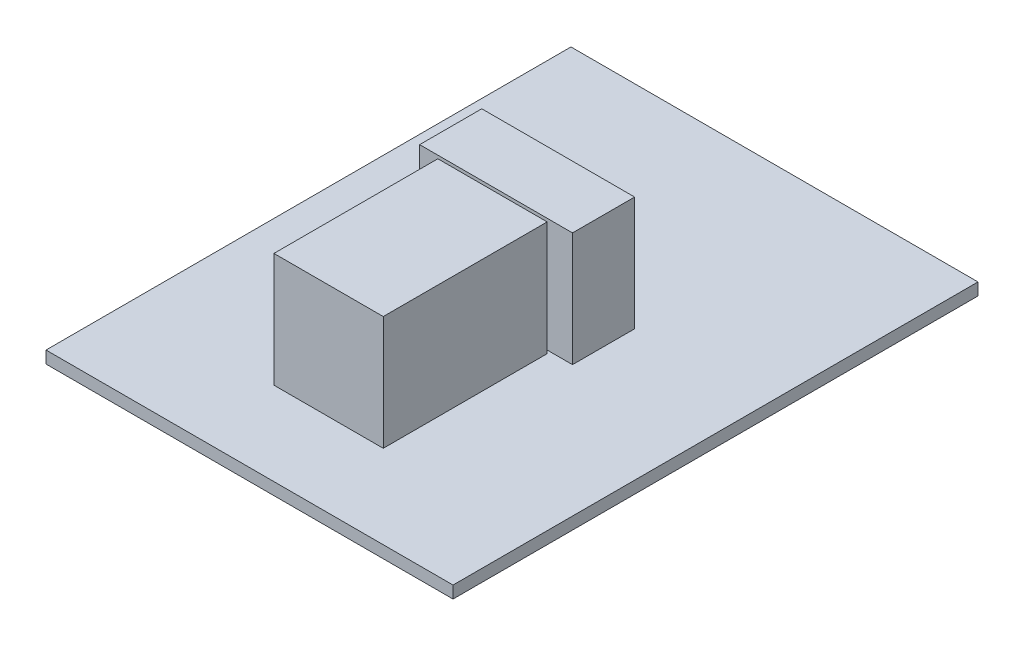
ISO-10303-21;
HEADER;
FILE_DESCRIPTION(('STEP AP214'),'2;1');
FILE_NAME('part.step','',(''),(''),'','','');
FILE_SCHEMA(('AUTOMOTIVE_DESIGN { 1 0 10303 214 1 1 1 1 }'));
ENDSEC;
DATA;
#1=APPLICATION_CONTEXT('core data for automotive mechanical design processes');
#2=APPLICATION_PROTOCOL_DEFINITION('international standard','automotive_design',2000,#1);
#3=PRODUCT_CONTEXT('',#1,'mechanical');
#4=PRODUCT('Part','Part','',(#3));
#5=PRODUCT_RELATED_PRODUCT_CATEGORY('part','',(#4));
#6=PRODUCT_DEFINITION_FORMATION('','',#4);
#7=PRODUCT_DEFINITION_CONTEXT('part definition',#1,'design');
#8=PRODUCT_DEFINITION('design','',#6,#7);
#9=PRODUCT_DEFINITION_SHAPE('','',#8);
#10=(LENGTH_UNIT() NAMED_UNIT(*) SI_UNIT(.MILLI.,.METRE.));
#11=(NAMED_UNIT(*) PLANE_ANGLE_UNIT() SI_UNIT($,.RADIAN.));
#12=(NAMED_UNIT(*) SI_UNIT($,.STERADIAN.) SOLID_ANGLE_UNIT());
#13=UNCERTAINTY_MEASURE_WITH_UNIT(LENGTH_MEASURE(1.E-05),#10,'distance_accuracy_value','');
#14=(GEOMETRIC_REPRESENTATION_CONTEXT(3) GLOBAL_UNCERTAINTY_ASSIGNED_CONTEXT((#13)) GLOBAL_UNIT_ASSIGNED_CONTEXT((#10,
#11,#12)) REPRESENTATION_CONTEXT('',''));
#15=CARTESIAN_POINT('',(0.,0.,0.));
#16=DIRECTION('',(0.,0.,1.));
#17=DIRECTION('',(1.,0.,0.));
#18=AXIS2_PLACEMENT_3D('',#15,#16,#17);
#19=CARTESIAN_POINT('',(53.5,1.6,-69.));
#20=DIRECTION('',(0.,-1.,0.));
#21=DIRECTION('',(0.,0.,-1.));
#22=AXIS2_PLACEMENT_3D('',#19,#20,#21);
#23=PLANE('',#22);
#24=DIRECTION('',(0.,0.,1.));
#25=VECTOR('',#24,1.);
#26=CARTESIAN_POINT('',(18.9824974393851,1.6,-10.9748289096387));
#27=LINE('',#26,#25);
#28=CARTESIAN_POINT('',(18.9824974393851,1.6,-32.5198358280829));
#29=VERTEX_POINT('',#28);
#30=CARTESIAN_POINT('',(18.9824974393851,1.6,-10.9748289096387));
#31=VERTEX_POINT('',#30);
#32=EDGE_CURVE('E172',#29,#31,#27,.T.);
#33=ORIENTED_EDGE('',*,*,#32,.F.);
#34=DIRECTION('',(-1.,0.,0.));
#35=VECTOR('',#34,1.);
#36=CARTESIAN_POINT('',(18.9824974393851,1.6,-32.5198358280829));
#37=LINE('',#36,#35);
#38=CARTESIAN_POINT('',(33.3533269301185,1.6,-32.5198358280829));
#39=VERTEX_POINT('',#38);
#40=EDGE_CURVE('E189',#39,#29,#37,.T.);
#41=ORIENTED_EDGE('',*,*,#40,.F.);
#42=DIRECTION('',(0.,0.,-1.));
#43=VECTOR('',#42,1.);
#44=CARTESIAN_POINT('',(33.3533269301185,1.6,-10.9748289096387));
#45=LINE('',#44,#43);
#46=CARTESIAN_POINT('',(33.3533269301185,1.6,-10.9748289096387));
#47=VERTEX_POINT('',#46);
#48=EDGE_CURVE('E202',#47,#39,#45,.T.);
#49=ORIENTED_EDGE('',*,*,#48,.F.);
#50=DIRECTION('',(1.,0.,0.));
#51=VECTOR('',#50,1.);
#52=CARTESIAN_POINT('',(18.9824974393851,1.6,-10.9748289096387));
#53=LINE('',#52,#51);
#54=EDGE_CURVE('E178',#31,#47,#53,.T.);
#55=ORIENTED_EDGE('',*,*,#54,.F.);
#56=EDGE_LOOP('',(#33,#41,#49,#55));
#57=FACE_BOUND('',#56,.T.);
#58=DIRECTION('',(0.,0.,-1.));
#59=VECTOR('',#58,1.);
#60=CARTESIAN_POINT('',(53.5,1.6,0.));
#61=LINE('',#60,#59);
#62=CARTESIAN_POINT('',(53.5,1.6,0.));
#63=VERTEX_POINT('',#62);
#64=CARTESIAN_POINT('',(53.5,1.6,-69.));
#65=VERTEX_POINT('',#64);
#66=EDGE_CURVE('E224',#63,#65,#61,.T.);
#67=ORIENTED_EDGE('',*,*,#66,.T.);
#68=DIRECTION('',(-1.,0.,0.));
#69=VECTOR('',#68,1.);
#70=CARTESIAN_POINT('',(0.,1.6,-69.));
#71=LINE('',#70,#69);
#72=CARTESIAN_POINT('',(0.,1.6,-69.));
#73=VERTEX_POINT('',#72);
#74=EDGE_CURVE('E228',#65,#73,#71,.T.);
#75=ORIENTED_EDGE('',*,*,#74,.T.);
#76=DIRECTION('',(0.,0.,1.));
#77=VECTOR('',#76,1.);
#78=CARTESIAN_POINT('',(0.,1.6,-69.));
#79=LINE('',#78,#77);
#80=CARTESIAN_POINT('',(0.,1.6,0.));
#81=VERTEX_POINT('',#80);
#82=EDGE_CURVE('E232',#73,#81,#79,.T.);
#83=ORIENTED_EDGE('',*,*,#82,.T.);
#84=DIRECTION('',(1.,0.,0.));
#85=VECTOR('',#84,1.);
#86=CARTESIAN_POINT('',(0.,1.6,0.));
#87=LINE('',#86,#85);
#88=EDGE_CURVE('E235',#81,#63,#87,.T.);
#89=ORIENTED_EDGE('',*,*,#88,.T.);
#90=EDGE_LOOP('',(#67,#75,#83,#89));
#91=FACE_BOUND('',#90,.T.);
#92=DIRECTION('',(0.,0.,1.));
#93=VECTOR('',#92,1.);
#94=CARTESIAN_POINT('',(16.1778659268137,1.6,-32.9338234642904));
#95=LINE('',#94,#93);
#96=CARTESIAN_POINT('',(16.1778659268137,1.6,-41.0976426044982));
#97=VERTEX_POINT('',#96);
#98=CARTESIAN_POINT('',(16.1778659268137,1.6,-32.9338234642904));
#99=VERTEX_POINT('',#98);
#100=EDGE_CURVE('E170',#97,#99,#95,.T.);
#101=ORIENTED_EDGE('',*,*,#100,.F.);
#102=DIRECTION('',(-1.,0.,0.));
#103=VECTOR('',#102,1.);
#104=CARTESIAN_POINT('',(16.1778659268137,1.6,-41.0976426044982));
#105=LINE('',#104,#103);
#106=CARTESIAN_POINT('',(36.2691980901353,1.6,-41.0976426044982));
#107=VERTEX_POINT('',#106);
#108=EDGE_CURVE('E167',#107,#97,#105,.T.);
#109=ORIENTED_EDGE('',*,*,#108,.F.);
#110=DIRECTION('',(0.,0.,-1.));
#111=VECTOR('',#110,1.);
#112=CARTESIAN_POINT('',(36.2691980901353,1.6,-32.9338234642904));
#113=LINE('',#112,#111);
#114=CARTESIAN_POINT('',(36.2691980901353,1.6,-32.9338234642904));
#115=VERTEX_POINT('',#114);
#116=EDGE_CURVE('E67',#115,#107,#113,.T.);
#117=ORIENTED_EDGE('',*,*,#116,.F.);
#118=DIRECTION('',(1.,0.,0.));
#119=VECTOR('',#118,1.);
#120=CARTESIAN_POINT('',(16.1778659268137,1.6,-32.9338234642904));
#121=LINE('',#120,#119);
#122=EDGE_CURVE('E59',#99,#115,#121,.T.);
#123=ORIENTED_EDGE('',*,*,#122,.F.);
#124=EDGE_LOOP('',(#101,#109,#117,#123));
#125=FACE_BOUND('',#124,.T.);
#126=ADVANCED_FACE('F40',(#57,#91,#125),#23,.F.);
#127=CARTESIAN_POINT('',(53.5,1.6,0.));
#128=DIRECTION('',(-1.,0.,0.));
#129=DIRECTION('',(0.,0.,1.));
#130=AXIS2_PLACEMENT_3D('',#127,#128,#129);
#131=PLANE('',#130);
#132=DIRECTION('',(0.,0.,-1.));
#133=VECTOR('',#132,1.);
#134=CARTESIAN_POINT('',(53.5,0.,0.));
#135=LINE('',#134,#133);
#136=CARTESIAN_POINT('',(53.5,0.,0.));
#137=VERTEX_POINT('',#136);
#138=CARTESIAN_POINT('',(53.5,0.,-69.));
#139=VERTEX_POINT('',#138);
#140=EDGE_CURVE('E223',#137,#139,#135,.T.);
#141=ORIENTED_EDGE('',*,*,#140,.T.);
#142=DIRECTION('',(0.,-1.,0.));
#143=VECTOR('',#142,1.);
#144=CARTESIAN_POINT('',(53.5,1.6,-69.));
#145=LINE('',#144,#143);
#146=EDGE_CURVE('E11',#65,#139,#145,.T.);
#147=ORIENTED_EDGE('',*,*,#146,.F.);
#148=ORIENTED_EDGE('',*,*,#66,.F.);
#149=DIRECTION('',(0.,-1.,0.));
#150=VECTOR('',#149,1.);
#151=CARTESIAN_POINT('',(53.5,1.6,0.));
#152=LINE('',#151,#150);
#153=EDGE_CURVE('E238',#63,#137,#152,.T.);
#154=ORIENTED_EDGE('',*,*,#153,.T.);
#155=EDGE_LOOP('',(#141,#147,#148,#154));
#156=FACE_BOUND('',#155,.T.);
#157=ADVANCED_FACE('F42',(#156),#131,.F.);
#158=CARTESIAN_POINT('',(0.,1.6,-69.));
#159=DIRECTION('',(0.,0.,1.));
#160=DIRECTION('',(1.,0.,0.));
#161=AXIS2_PLACEMENT_3D('',#158,#159,#160);
#162=PLANE('',#161);
#163=DIRECTION('',(-1.,0.,0.));
#164=VECTOR('',#163,1.);
#165=CARTESIAN_POINT('',(0.,0.,-69.));
#166=LINE('',#165,#164);
#167=CARTESIAN_POINT('',(0.,0.,-69.));
#168=VERTEX_POINT('',#167);
#169=EDGE_CURVE('E242',#139,#168,#166,.T.);
#170=ORIENTED_EDGE('',*,*,#169,.T.);
#171=DIRECTION('',(0.,-1.,0.));
#172=VECTOR('',#171,1.);
#173=CARTESIAN_POINT('',(0.,1.6,-69.));
#174=LINE('',#173,#172);
#175=EDGE_CURVE('E49',#73,#168,#174,.T.);
#176=ORIENTED_EDGE('',*,*,#175,.F.);
#177=ORIENTED_EDGE('',*,*,#74,.F.);
#178=ORIENTED_EDGE('',*,*,#146,.T.);
#179=EDGE_LOOP('',(#170,#176,#177,#178));
#180=FACE_BOUND('',#179,.T.);
#181=ADVANCED_FACE('F275',(#180),#162,.F.);
#182=CARTESIAN_POINT('',(0.,1.6,-69.));
#183=DIRECTION('',(1.,0.,0.));
#184=DIRECTION('',(0.,0.,-1.));
#185=AXIS2_PLACEMENT_3D('',#182,#183,#184);
#186=PLANE('',#185);
#187=DIRECTION('',(0.,0.,1.));
#188=VECTOR('',#187,1.);
#189=CARTESIAN_POINT('',(0.,0.,-69.));
#190=LINE('',#189,#188);
#191=CARTESIAN_POINT('',(0.,0.,0.));
#192=VERTEX_POINT('',#191);
#193=EDGE_CURVE('E245',#168,#192,#190,.T.);
#194=ORIENTED_EDGE('',*,*,#193,.T.);
#195=DIRECTION('',(0.,-1.,0.));
#196=VECTOR('',#195,1.);
#197=CARTESIAN_POINT('',(0.,1.6,0.));
#198=LINE('',#197,#196);
#199=EDGE_CURVE('E252',#81,#192,#198,.T.);
#200=ORIENTED_EDGE('',*,*,#199,.F.);
#201=ORIENTED_EDGE('',*,*,#82,.F.);
#202=ORIENTED_EDGE('',*,*,#175,.T.);
#203=EDGE_LOOP('',(#194,#200,#201,#202));
#204=FACE_BOUND('',#203,.T.);
#205=ADVANCED_FACE('F260',(#204),#186,.F.);
#206=CARTESIAN_POINT('',(0.,1.6,0.));
#207=DIRECTION('',(0.,0.,-1.));
#208=DIRECTION('',(-1.,0.,0.));
#209=AXIS2_PLACEMENT_3D('',#206,#207,#208);
#210=PLANE('',#209);
#211=DIRECTION('',(1.,0.,0.));
#212=VECTOR('',#211,1.);
#213=CARTESIAN_POINT('',(0.,0.,0.));
#214=LINE('',#213,#212);
#215=EDGE_CURVE('E229',#192,#137,#214,.T.);
#216=ORIENTED_EDGE('',*,*,#215,.T.);
#217=ORIENTED_EDGE('',*,*,#153,.F.);
#218=ORIENTED_EDGE('',*,*,#88,.F.);
#219=ORIENTED_EDGE('',*,*,#199,.T.);
#220=EDGE_LOOP('',(#216,#217,#218,#219));
#221=FACE_BOUND('',#220,.T.);
#222=ADVANCED_FACE('F269',(#221),#210,.F.);
#223=CARTESIAN_POINT('',(53.5,0.,-69.));
#224=DIRECTION('',(0.,-1.,0.));
#225=DIRECTION('',(0.,0.,-1.));
#226=AXIS2_PLACEMENT_3D('',#223,#224,#225);
#227=PLANE('',#226);
#228=ORIENTED_EDGE('',*,*,#140,.F.);
#229=ORIENTED_EDGE('',*,*,#215,.F.);
#230=ORIENTED_EDGE('',*,*,#193,.F.);
#231=ORIENTED_EDGE('',*,*,#169,.F.);
#232=EDGE_LOOP('',(#228,#229,#230,#231));
#233=FACE_BOUND('',#232,.T.);
#234=ADVANCED_FACE('F266',(#233),#227,.T.);
#235=CARTESIAN_POINT('',(18.9824974393851,16.6,-10.9748289096387));
#236=DIRECTION('',(1.,0.,0.));
#237=DIRECTION('',(0.,0.,-1.));
#238=AXIS2_PLACEMENT_3D('',#235,#236,#237);
#239=PLANE('',#238);
#240=ORIENTED_EDGE('',*,*,#32,.T.);
#241=DIRECTION('',(0.,-1.,0.));
#242=VECTOR('',#241,1.);
#243=CARTESIAN_POINT('',(18.9824974393851,16.6,-10.9748289096387));
#244=LINE('',#243,#242);
#245=CARTESIAN_POINT('',(18.9824974393851,16.6,-10.9748289096387));
#246=VERTEX_POINT('',#245);
#247=EDGE_CURVE('E219',#246,#31,#244,.T.);
#248=ORIENTED_EDGE('',*,*,#247,.F.);
#249=DIRECTION('',(0.,0.,1.));
#250=VECTOR('',#249,1.);
#251=CARTESIAN_POINT('',(18.9824974393851,16.6,-10.9748289096387));
#252=LINE('',#251,#250);
#253=CARTESIAN_POINT('',(18.9824974393851,16.6,-32.5198358280829));
#254=VERTEX_POINT('',#253);
#255=EDGE_CURVE('E185',#254,#246,#252,.T.);
#256=ORIENTED_EDGE('',*,*,#255,.F.);
#257=DIRECTION('',(0.,-1.,0.));
#258=VECTOR('',#257,1.);
#259=CARTESIAN_POINT('',(18.9824974393851,16.6,-32.5198358280829));
#260=LINE('',#259,#258);
#261=EDGE_CURVE('E197',#254,#29,#260,.T.);
#262=ORIENTED_EDGE('',*,*,#261,.T.);
#263=EDGE_LOOP('',(#240,#248,#256,#262));
#264=FACE_BOUND('',#263,.T.);
#265=ADVANCED_FACE('F289',(#264),#239,.F.);
#266=CARTESIAN_POINT('',(18.9824974393851,16.6,-10.9748289096387));
#267=DIRECTION('',(0.,0.,-1.));
#268=DIRECTION('',(-1.,0.,0.));
#269=AXIS2_PLACEMENT_3D('',#266,#267,#268);
#270=PLANE('',#269);
#271=ORIENTED_EDGE('',*,*,#54,.T.);
#272=DIRECTION('',(0.,-1.,0.));
#273=VECTOR('',#272,1.);
#274=CARTESIAN_POINT('',(33.3533269301185,16.6,-10.9748289096387));
#275=LINE('',#274,#273);
#276=CARTESIAN_POINT('',(33.3533269301185,16.6,-10.9748289096387));
#277=VERTEX_POINT('',#276);
#278=EDGE_CURVE('E216',#277,#47,#275,.T.);
#279=ORIENTED_EDGE('',*,*,#278,.F.);
#280=DIRECTION('',(1.,0.,0.));
#281=VECTOR('',#280,1.);
#282=CARTESIAN_POINT('',(18.9824974393851,16.6,-10.9748289096387));
#283=LINE('',#282,#281);
#284=EDGE_CURVE('E188',#246,#277,#283,.T.);
#285=ORIENTED_EDGE('',*,*,#284,.F.);
#286=ORIENTED_EDGE('',*,*,#247,.T.);
#287=EDGE_LOOP('',(#271,#279,#285,#286));
#288=FACE_BOUND('',#287,.T.);
#289=ADVANCED_FACE('F308',(#288),#270,.F.);
#290=CARTESIAN_POINT('',(33.3533269301185,16.6,-10.9748289096387));
#291=DIRECTION('',(-1.,0.,0.));
#292=DIRECTION('',(0.,0.,1.));
#293=AXIS2_PLACEMENT_3D('',#290,#291,#292);
#294=PLANE('',#293);
#295=ORIENTED_EDGE('',*,*,#48,.T.);
#296=DIRECTION('',(0.,-1.,0.));
#297=VECTOR('',#296,1.);
#298=CARTESIAN_POINT('',(33.3533269301185,16.6,-32.5198358280829));
#299=LINE('',#298,#297);
#300=CARTESIAN_POINT('',(33.3533269301185,16.6,-32.5198358280829));
#301=VERTEX_POINT('',#300);
#302=EDGE_CURVE('E212',#301,#39,#299,.T.);
#303=ORIENTED_EDGE('',*,*,#302,.F.);
#304=DIRECTION('',(0.,0.,-1.));
#305=VECTOR('',#304,1.);
#306=CARTESIAN_POINT('',(33.3533269301185,16.6,-10.9748289096387));
#307=LINE('',#306,#305);
#308=EDGE_CURVE('E192',#277,#301,#307,.T.);
#309=ORIENTED_EDGE('',*,*,#308,.F.);
#310=ORIENTED_EDGE('',*,*,#278,.T.);
#311=EDGE_LOOP('',(#295,#303,#309,#310));
#312=FACE_BOUND('',#311,.T.);
#313=ADVANCED_FACE('F316',(#312),#294,.F.);
#314=CARTESIAN_POINT('',(18.9824974393851,16.6,-32.5198358280829));
#315=DIRECTION('',(0.,0.,1.));
#316=DIRECTION('',(1.,0.,0.));
#317=AXIS2_PLACEMENT_3D('',#314,#315,#316);
#318=PLANE('',#317);
#319=ORIENTED_EDGE('',*,*,#40,.T.);
#320=ORIENTED_EDGE('',*,*,#261,.F.);
#321=DIRECTION('',(-1.,0.,0.));
#322=VECTOR('',#321,1.);
#323=CARTESIAN_POINT('',(18.9824974393851,16.6,-32.5198358280829));
#324=LINE('',#323,#322);
#325=EDGE_CURVE('E195',#301,#254,#324,.T.);
#326=ORIENTED_EDGE('',*,*,#325,.F.);
#327=ORIENTED_EDGE('',*,*,#302,.T.);
#328=EDGE_LOOP('',(#319,#320,#326,#327));
#329=FACE_BOUND('',#328,.T.);
#330=ADVANCED_FACE('F323',(#329),#318,.F.);
#331=CARTESIAN_POINT('',(18.9824974393851,16.6,-32.5198358280829));
#332=DIRECTION('',(0.,-1.,0.));
#333=DIRECTION('',(0.,0.,-1.));
#334=AXIS2_PLACEMENT_3D('',#331,#332,#333);
#335=PLANE('',#334);
#336=ORIENTED_EDGE('',*,*,#255,.T.);
#337=ORIENTED_EDGE('',*,*,#284,.T.);
#338=ORIENTED_EDGE('',*,*,#308,.T.);
#339=ORIENTED_EDGE('',*,*,#325,.T.);
#340=EDGE_LOOP('',(#336,#337,#338,#339));
#341=FACE_BOUND('',#340,.T.);
#342=ADVANCED_FACE('F331',(#341),#335,.F.);
#343=CARTESIAN_POINT('',(16.1778659268137,16.6,-32.9338234642904));
#344=DIRECTION('',(1.,0.,0.));
#345=DIRECTION('',(0.,0.,-1.));
#346=AXIS2_PLACEMENT_3D('',#343,#344,#345);
#347=PLANE('',#346);
#348=ORIENTED_EDGE('',*,*,#100,.T.);
#349=DIRECTION('',(0.,-1.,0.));
#350=VECTOR('',#349,1.);
#351=CARTESIAN_POINT('',(16.1778659268137,16.6,-32.9338234642904));
#352=LINE('',#351,#350);
#353=CARTESIAN_POINT('',(16.1778659268137,16.6,-32.9338234642904));
#354=VERTEX_POINT('',#353);
#355=EDGE_CURVE('E149',#354,#99,#352,.T.);
#356=ORIENTED_EDGE('',*,*,#355,.F.);
#357=DIRECTION('',(0.,0.,1.));
#358=VECTOR('',#357,1.);
#359=CARTESIAN_POINT('',(16.1778659268137,16.6,-32.9338234642904));
#360=LINE('',#359,#358);
#361=CARTESIAN_POINT('',(16.1778659268137,16.6,-41.0976426044982));
#362=VERTEX_POINT('',#361);
#363=EDGE_CURVE('E157',#362,#354,#360,.T.);
#364=ORIENTED_EDGE('',*,*,#363,.F.);
#365=DIRECTION('',(0.,-1.,0.));
#366=VECTOR('',#365,1.);
#367=CARTESIAN_POINT('',(16.1778659268137,16.6,-41.0976426044982));
#368=LINE('',#367,#366);
#369=EDGE_CURVE('E425',#362,#97,#368,.T.);
#370=ORIENTED_EDGE('',*,*,#369,.T.);
#371=EDGE_LOOP('',(#348,#356,#364,#370));
#372=FACE_BOUND('',#371,.T.);
#373=ADVANCED_FACE('F169',(#372),#347,.F.);
#374=CARTESIAN_POINT('',(16.1778659268137,16.6,-32.9338234642904));
#375=DIRECTION('',(0.,0.,-1.));
#376=DIRECTION('',(-1.,0.,0.));
#377=AXIS2_PLACEMENT_3D('',#374,#375,#376);
#378=PLANE('',#377);
#379=ORIENTED_EDGE('',*,*,#122,.T.);
#380=DIRECTION('',(0.,-1.,0.));
#381=VECTOR('',#380,1.);
#382=CARTESIAN_POINT('',(36.2691980901353,16.6,-32.9338234642904));
#383=LINE('',#382,#381);
#384=CARTESIAN_POINT('',(36.2691980901353,16.6,-32.9338234642904));
#385=VERTEX_POINT('',#384);
#386=EDGE_CURVE('E152',#385,#115,#383,.T.);
#387=ORIENTED_EDGE('',*,*,#386,.F.);
#388=DIRECTION('',(1.,0.,0.));
#389=VECTOR('',#388,1.);
#390=CARTESIAN_POINT('',(16.1778659268137,16.6,-32.9338234642904));
#391=LINE('',#390,#389);
#392=EDGE_CURVE('E145',#354,#385,#391,.T.);
#393=ORIENTED_EDGE('',*,*,#392,.F.);
#394=ORIENTED_EDGE('',*,*,#355,.T.);
#395=EDGE_LOOP('',(#379,#387,#393,#394));
#396=FACE_BOUND('',#395,.T.);
#397=ADVANCED_FACE('F147',(#396),#378,.F.);
#398=CARTESIAN_POINT('',(36.2691980901353,16.6,-32.9338234642904));
#399=DIRECTION('',(-1.,0.,0.));
#400=DIRECTION('',(0.,0.,1.));
#401=AXIS2_PLACEMENT_3D('',#398,#399,#400);
#402=PLANE('',#401);
#403=ORIENTED_EDGE('',*,*,#116,.T.);
#404=DIRECTION('',(0.,-1.,0.));
#405=VECTOR('',#404,1.);
#406=CARTESIAN_POINT('',(36.2691980901353,16.6,-41.0976426044982));
#407=LINE('',#406,#405);
#408=CARTESIAN_POINT('',(36.2691980901353,16.6,-41.0976426044982));
#409=VERTEX_POINT('',#408);
#410=EDGE_CURVE('E181',#409,#107,#407,.T.);
#411=ORIENTED_EDGE('',*,*,#410,.F.);
#412=DIRECTION('',(0.,0.,-1.));
#413=VECTOR('',#412,1.);
#414=CARTESIAN_POINT('',(36.2691980901353,16.6,-32.9338234642904));
#415=LINE('',#414,#413);
#416=EDGE_CURVE('E156',#385,#409,#415,.T.);
#417=ORIENTED_EDGE('',*,*,#416,.F.);
#418=ORIENTED_EDGE('',*,*,#386,.T.);
#419=EDGE_LOOP('',(#403,#411,#417,#418));
#420=FACE_BOUND('',#419,.T.);
#421=ADVANCED_FACE('F352',(#420),#402,.F.);
#422=CARTESIAN_POINT('',(16.1778659268137,16.6,-41.0976426044982));
#423=DIRECTION('',(0.,0.,1.));
#424=DIRECTION('',(1.,0.,0.));
#425=AXIS2_PLACEMENT_3D('',#422,#423,#424);
#426=PLANE('',#425);
#427=ORIENTED_EDGE('',*,*,#108,.T.);
#428=ORIENTED_EDGE('',*,*,#369,.F.);
#429=DIRECTION('',(-1.,0.,0.));
#430=VECTOR('',#429,1.);
#431=CARTESIAN_POINT('',(16.1778659268137,16.6,-41.0976426044982));
#432=LINE('',#431,#430);
#433=EDGE_CURVE('E162',#409,#362,#432,.T.);
#434=ORIENTED_EDGE('',*,*,#433,.F.);
#435=ORIENTED_EDGE('',*,*,#410,.T.);
#436=EDGE_LOOP('',(#427,#428,#434,#435));
#437=FACE_BOUND('',#436,.T.);
#438=ADVANCED_FACE('F359',(#437),#426,.F.);
#439=CARTESIAN_POINT('',(16.1778659268137,16.6,-41.0976426044982));
#440=DIRECTION('',(0.,-1.,0.));
#441=DIRECTION('',(0.,0.,-1.));
#442=AXIS2_PLACEMENT_3D('',#439,#440,#441);
#443=PLANE('',#442);
#444=ORIENTED_EDGE('',*,*,#363,.T.);
#445=ORIENTED_EDGE('',*,*,#392,.T.);
#446=ORIENTED_EDGE('',*,*,#416,.T.);
#447=ORIENTED_EDGE('',*,*,#433,.T.);
#448=EDGE_LOOP('',(#444,#445,#446,#447));
#449=FACE_BOUND('',#448,.T.);
#450=ADVANCED_FACE('F160',(#449),#443,.F.);
#451=CLOSED_SHELL('',(#126,#157,#181,#205,#222,#234,#265,#289,#313,#330,#342,#373,#397,#421,
#438,#450));
#452=MANIFOLD_SOLID_BREP('B2',#451);
#453=ADVANCED_BREP_SHAPE_REPRESENTATION('',(#18,#452),#14);
#454=SHAPE_DEFINITION_REPRESENTATION(#9,#453);
ENDSEC;
END-ISO-10303-21;
